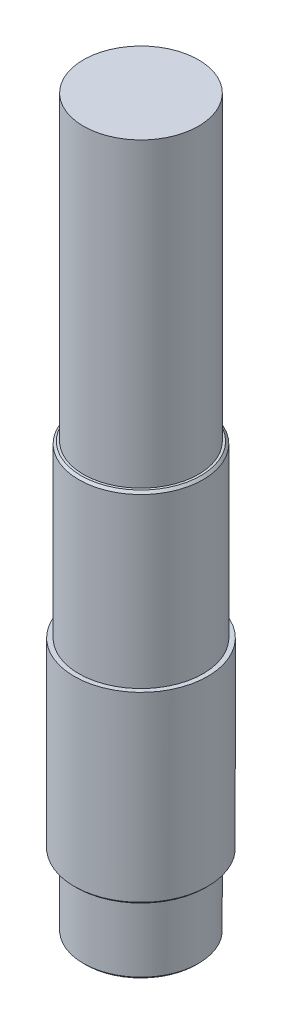
ISO-10303-21;
HEADER;
FILE_DESCRIPTION(('STEP AP214'),'2;1');
FILE_NAME('part.step','',(''),(''),'','','');
FILE_SCHEMA(('AUTOMOTIVE_DESIGN { 1 0 10303 214 1 1 1 1 }'));
ENDSEC;
DATA;
#1=APPLICATION_CONTEXT('core data for automotive mechanical design processes');
#2=APPLICATION_PROTOCOL_DEFINITION('international standard','automotive_design',2000,#1);
#3=PRODUCT_CONTEXT('',#1,'mechanical');
#4=PRODUCT('Part','Part','',(#3));
#5=PRODUCT_RELATED_PRODUCT_CATEGORY('part','',(#4));
#6=PRODUCT_DEFINITION_FORMATION('','',#4);
#7=PRODUCT_DEFINITION_CONTEXT('part definition',#1,'design');
#8=PRODUCT_DEFINITION('design','',#6,#7);
#9=PRODUCT_DEFINITION_SHAPE('','',#8);
#10=(LENGTH_UNIT() NAMED_UNIT(*) SI_UNIT(.MILLI.,.METRE.));
#11=(NAMED_UNIT(*) PLANE_ANGLE_UNIT() SI_UNIT($,.RADIAN.));
#12=(NAMED_UNIT(*) SI_UNIT($,.STERADIAN.) SOLID_ANGLE_UNIT());
#13=UNCERTAINTY_MEASURE_WITH_UNIT(LENGTH_MEASURE(1.E-05),#10,'distance_accuracy_value','');
#14=(GEOMETRIC_REPRESENTATION_CONTEXT(3) GLOBAL_UNCERTAINTY_ASSIGNED_CONTEXT((#13)) GLOBAL_UNIT_ASSIGNED_CONTEXT((#10,
#11,#12)) REPRESENTATION_CONTEXT('',''));
#15=CARTESIAN_POINT('',(0.,0.,0.));
#16=DIRECTION('',(0.,0.,1.));
#17=DIRECTION('',(1.,0.,0.));
#18=AXIS2_PLACEMENT_3D('',#15,#16,#17);
#19=CARTESIAN_POINT('',(0.,87.3913043478261,0.));
#20=DIRECTION('',(0.,1.,0.));
#21=DIRECTION('',(0.,0.,1.));
#22=AXIS2_PLACEMENT_3D('',#19,#20,#21);
#23=CYLINDRICAL_SURFACE('',#22,25.);
#24=CARTESIAN_POINT('',(0.,56.3913043478261,0.));
#25=DIRECTION('',(0.,1.,0.));
#26=DIRECTION('',(0.,0.,1.));
#27=AXIS2_PLACEMENT_3D('',#24,#25,#26);
#28=CIRCLE('',#27,25.);
#29=CARTESIAN_POINT('',(0.,56.3913043478261,25.));
#30=VERTEX_POINT('',#29);
#31=EDGE_CURVE('E136',#30,#30,#28,.T.);
#32=ORIENTED_EDGE('',*,*,#31,.T.);
#33=EDGE_LOOP('',(#32));
#34=FACE_BOUND('',#33,.T.);
#35=CARTESIAN_POINT('',(0.,187.391304347826,0.));
#36=DIRECTION('',(0.,1.,0.));
#37=DIRECTION('',(0.,0.,1.));
#38=AXIS2_PLACEMENT_3D('',#35,#36,#37);
#39=CIRCLE('',#38,25.);
#40=CARTESIAN_POINT('',(0.,187.391304347826,25.));
#41=VERTEX_POINT('',#40);
#42=EDGE_CURVE('E105',#41,#41,#39,.T.);
#43=ORIENTED_EDGE('',*,*,#42,.F.);
#44=EDGE_LOOP('',(#43));
#45=FACE_BOUND('',#44,.T.);
#46=ADVANCED_FACE('F41',(#34,#45),#23,.T.);
#47=CARTESIAN_POINT('',(-25.,56.3913043478261,0.));
#48=DIRECTION('',(0.,1.,0.));
#49=DIRECTION('',(0.,0.,1.));
#50=AXIS2_PLACEMENT_3D('',#47,#48,#49);
#51=PLANE('',#50);
#52=CARTESIAN_POINT('',(0.,56.3913043478261,0.));
#53=DIRECTION('',(0.,1.,0.));
#54=DIRECTION('',(0.,0.,1.));
#55=AXIS2_PLACEMENT_3D('',#52,#53,#54);
#56=CIRCLE('',#55,26.);
#57=CARTESIAN_POINT('',(0.,56.3913043478261,26.));
#58=VERTEX_POINT('',#57);
#59=EDGE_CURVE('E148',#58,#58,#56,.T.);
#60=ORIENTED_EDGE('',*,*,#59,.T.);
#61=EDGE_LOOP('',(#60));
#62=FACE_BOUND('',#61,.T.);
#63=ORIENTED_EDGE('',*,*,#31,.F.);
#64=EDGE_LOOP('',(#63));
#65=FACE_BOUND('',#64,.T.);
#66=ADVANCED_FACE('F203',(#62,#65),#51,.T.);
#67=CARTESIAN_POINT('',(0.,87.3913043478261,0.));
#68=DIRECTION('',(0.,1.,0.));
#69=DIRECTION('',(0.,0.,1.));
#70=AXIS2_PLACEMENT_3D('',#67,#68,#69);
#71=CYLINDRICAL_SURFACE('',#70,27.);
#72=CARTESIAN_POINT('',(-25.7875939164552,38.911705116802,8.));
#73=CARTESIAN_POINT('',(-25.7875628616702,39.131397825484,8.00002960637348));
#74=CARTESIAN_POINT('',(-25.7904003183758,39.3510792729381,7.99095167950051));
#75=CARTESIAN_POINT('',(-25.8015855612365,39.7887682714789,7.95479988213666));
#76=CARTESIAN_POINT('',(-25.8099321340495,40.0067761804568,7.92772997423787));
#77=CARTESIAN_POINT('',(-25.8318817944391,40.4390271410023,7.85590251670967));
#78=CARTESIAN_POINT('',(-25.8454717680868,40.6532782019662,7.8111890878576));
#79=CARTESIAN_POINT('',(-25.8774835872328,41.0770631359052,7.70447684520099));
#80=CARTESIAN_POINT('',(-25.8959055541593,41.2865968901905,7.64247759700054));
#81=CARTESIAN_POINT('',(-25.9370211553073,41.6993990583558,7.50175261605655));
#82=CARTESIAN_POINT('',(-25.9597123660459,41.902670951037,7.42303636965148));
#83=CARTESIAN_POINT('',(-26.0087228446599,42.3018252601322,7.24944609768949));
#84=CARTESIAN_POINT('',(-26.0350434570479,42.4977049036758,7.15456608118007));
#85=CARTESIAN_POINT('',(-26.0905704443794,42.880811193208,6.94934739689978));
#86=CARTESIAN_POINT('',(-26.1197774094702,43.0680360580964,6.83900556585143));
#87=CARTESIAN_POINT('',(-26.180274355834,43.4326672239909,6.60363499882668));
#88=CARTESIAN_POINT('',(-26.2115644479112,43.6100730017865,6.47860548132232));
#89=CARTESIAN_POINT('',(-26.2762794142755,43.9587861997689,6.21100682882993));
#90=CARTESIAN_POINT('',(-26.3097394429693,44.1297873946886,6.06804699596594));
#91=CARTESIAN_POINT('',(-26.3770553137928,44.4592320525428,5.76840763620857));
#92=CARTESIAN_POINT('',(-26.4109111624612,44.6176753076938,5.6117278823957));
#93=CARTESIAN_POINT('',(-26.4781048452257,44.9210246877542,5.28561059087526));
#94=CARTESIAN_POINT('',(-26.5114425842848,45.0659283529626,5.11617074513389));
#95=CARTESIAN_POINT('',(-26.5766930590516,45.3412073259223,4.76562331858905));
#96=CARTESIAN_POINT('',(-26.6086058356416,45.4715830506412,4.584516072888));
#97=CARTESIAN_POINT('',(-26.6707742819151,45.7194130460702,4.20796189181386));
#98=CARTESIAN_POINT('',(-26.7009828857717,45.8365495850899,4.01229784329226));
#99=CARTESIAN_POINT('',(-26.7581552760822,46.0538238248622,3.61138545306112));
#100=CARTESIAN_POINT('',(-26.7851202442125,46.1539677216314,3.40614063973835));
#101=CARTESIAN_POINT('',(-26.8350466756659,46.3364906279072,2.98742640587611));
#102=CARTESIAN_POINT('',(-26.858008194866,46.4188698853623,2.77395710017838));
#103=CARTESIAN_POINT('',(-26.8992608498159,46.565146376425,2.34033902524584));
#104=CARTESIAN_POINT('',(-26.9175521412085,46.6290442259647,2.12019047888114));
#105=CARTESIAN_POINT('',(-26.9484881220029,46.7362544310541,1.6810915561189));
#106=CARTESIAN_POINT('',(-26.9612762416528,46.7800918547577,1.4622794239887));
#107=CARTESIAN_POINT('',(-26.9815707332709,46.8493532946463,1.02152013329362));
#108=CARTESIAN_POINT('',(-26.9890772696515,46.8747778840125,0.799573072536613));
#109=CARTESIAN_POINT('',(-26.9985944902582,46.9069750596485,0.35424578220218));
#110=CARTESIAN_POINT('',(-27.0006059952982,46.9137504316238,0.130865771667076));
#111=CARTESIAN_POINT('',(-26.9990778203608,46.9085926473642,-0.3156570295136));
#112=CARTESIAN_POINT('',(-26.9955382395449,46.8966598253214,-0.538799824325399));
#113=CARTESIAN_POINT('',(-26.9832061949929,46.8548655343941,-0.97619095265371));
#114=CARTESIAN_POINT('',(-26.9745816226041,46.8255769513461,-1.19049906423914));
#115=CARTESIAN_POINT('',(-26.9524459467939,46.7497951432446,-1.61586825577758));
#116=CARTESIAN_POINT('',(-26.938933207224,46.7032961574703,-1.82692822383494));
#117=CARTESIAN_POINT('',(-26.9073837322259,46.5935056865423,-2.24420823618411));
#118=CARTESIAN_POINT('',(-26.8893485034535,46.530219793499,-2.45042986738414));
#119=CARTESIAN_POINT('',(-26.8492143437572,46.3873329093306,-2.85681641733498));
#120=CARTESIAN_POINT('',(-26.8271138856206,46.3077257854046,-3.0569790268306));
#121=CARTESIAN_POINT('',(-26.7791567788165,46.131848628904,-3.45207239061677));
#122=CARTESIAN_POINT('',(-26.753261162676,46.0354034612365,-3.64692041889215));
#123=CARTESIAN_POINT('',(-26.6985625126211,45.827146853307,-4.02787897880358));
#124=CARTESIAN_POINT('',(-26.6697584815258,45.7153301379652,-4.21398648139633));
#125=CARTESIAN_POINT('',(-26.6099889077739,45.4771294940877,-4.57626483368281));
#126=CARTESIAN_POINT('',(-26.5790233498109,45.3507454623918,-4.75243561299525));
#127=CARTESIAN_POINT('',(-26.5157195353945,45.0842357297938,-5.09379604977026));
#128=CARTESIAN_POINT('',(-26.4833812399672,44.9441096385865,-5.25898539511194));
#129=CARTESIAN_POINT('',(-26.4169236189529,44.6454504693369,-5.58342133511416));
#130=CARTESIAN_POINT('',(-26.3827831476584,44.4864221675424,-5.74220807182533));
#131=CARTESIAN_POINT('',(-26.3148652712975,44.155590050217,-6.04583040421573));
#132=CARTESIAN_POINT('',(-26.2810877527561,43.9837903689452,-6.19067048005944));
#133=CARTESIAN_POINT('',(-26.2148077749369,43.6283402689371,-6.46559092955974));
#134=CARTESIAN_POINT('',(-26.1823061764369,43.4446820636958,-6.59566144745518));
#135=CARTESIAN_POINT('',(-26.1195451631916,43.0668610855521,-6.83997573312998));
#136=CARTESIAN_POINT('',(-26.089284879471,42.8727024348057,-6.95422564977779));
#137=CARTESIAN_POINT('',(-26.0315916367044,42.473059330601,-7.16718478187234));
#138=CARTESIAN_POINT('',(-26.0041904120745,42.2674800956456,-7.26572490624362));
#139=CARTESIAN_POINT('',(-25.9534283091206,41.8483178551212,-7.44501460023963));
#140=CARTESIAN_POINT('',(-25.9300657823772,41.6347381585039,-7.52577143192785));
#141=CARTESIAN_POINT('',(-25.8881357781189,41.2012575397424,-7.66876663345914));
#142=CARTESIAN_POINT('',(-25.8695632646646,40.981363528728,-7.73102446263393));
#143=CARTESIAN_POINT('',(-25.8377961282602,40.536774757578,-7.836537473345));
#144=CARTESIAN_POINT('',(-25.8245990221313,40.3120822647112,-7.87980142985505));
#145=CARTESIAN_POINT('',(-25.8054734018974,39.8915410335106,-7.9421969480022));
#146=CARTESIAN_POINT('',(-25.7987815539257,39.6961005738651,-7.9638738523907));
#147=CARTESIAN_POINT('',(-25.7898355738642,39.3043468186609,-7.9927731450363));
#148=CARTESIAN_POINT('',(-25.7875748486612,39.108035256133,-8.00001700863013));
#149=CARTESIAN_POINT('',(-25.7875939164552,38.911705116802,-8.));
#150=B_SPLINE_CURVE_WITH_KNOTS('',3,(#72,#73,#74,#75,#76,#77,#78,#79,#80,#81,#82,#83,#84,#85,
#86,#87,#88,#89,#90,#91,#92,#93,#94,#95,#96,#97,#98,#99,#100,#101,#102,#103,#104,#105,#106,#107,
#108,#109,#110,#111,#112,#113,#114,#115,#116,#117,#118,#119,#120,#121,#122,#123,#124,#125,#126,
#127,#128,#129,#130,#131,#132,#133,#134,#135,#136,#137,#138,#139,#140,#141,#142,#143,#144,#145,
#146,#147,#148,#149),.UNSPECIFIED.,.F.,.F.,(4,2,2,2,2,2,2,2,2,2,2,2,2,2,2,2,2,2,2,2,2,2,2,2,2,2,
2,2,2,2,2,2,2,2,2,2,2,2,4),(0.,0.658854993446906,1.31756492733443,1.97463797350892,
2.63172753354213,3.28844520880093,3.945406822098,4.60250303759593,5.2596342328621,
5.9350165709738,6.61041008162646,7.28592605162941,7.96142262860486,8.65069477564224,
9.33971505119042,10.0287257091685,10.7177134017575,11.3874592450027,12.0571842385397,
12.726809187238,13.3964221742889,14.0450752449532,14.693945631482,15.3426001350138,
15.9914988225676,16.6475996408492,17.3039261790308,17.9602573653548,18.6166071983477,
19.2977382995345,19.978649862033,20.6600131608745,21.3411108918289,22.0291058464085,
22.7168193251783,23.4038068074954,24.0904765738187,24.6801642951606,25.268973945975),.UNSPECIFIED.);
#151=CARTESIAN_POINT('',(-25.7875939164552,38.911705116802,8.));
#152=VERTEX_POINT('',#151);
#153=CARTESIAN_POINT('',(-25.7875939164552,38.911705116802,-8.));
#154=VERTEX_POINT('',#153);
#155=EDGE_CURVE('E164',#152,#154,#150,.T.);
#156=ORIENTED_EDGE('',*,*,#155,.F.);
#157=DIRECTION('',(0.,1.,0.));
#158=VECTOR('',#157,1.);
#159=CARTESIAN_POINT('',(-25.7875939164552,87.3913043478261,8.));
#160=LINE('',#159,#158);
#161=CARTESIAN_POINT('',(-25.7875939164552,-9.088294883198,8.));
#162=VERTEX_POINT('',#161);
#163=EDGE_CURVE('E11',#162,#152,#160,.T.);
#164=ORIENTED_EDGE('',*,*,#163,.F.);
#165=CARTESIAN_POINT('',(-25.7875939164552,-9.088294883198,-8.));
#166=CARTESIAN_POINT('',(-25.7875628616702,-9.30798759187996,-8.00002960637348));
#167=CARTESIAN_POINT('',(-25.7904003183758,-9.52766903933414,-7.99095167950051));
#168=CARTESIAN_POINT('',(-25.8015855612365,-9.96535803787485,-7.95479988213667));
#169=CARTESIAN_POINT('',(-25.8099321340495,-10.1833659468528,-7.92772997423787));
#170=CARTESIAN_POINT('',(-25.8318817944391,-10.6156169073983,-7.85590251670967));
#171=CARTESIAN_POINT('',(-25.8454717680868,-10.8298679683622,-7.81118908785759));
#172=CARTESIAN_POINT('',(-25.8774835872328,-11.2536529023012,-7.70447684520099));
#173=CARTESIAN_POINT('',(-25.8959055541593,-11.4631866565865,-7.64247759700054));
#174=CARTESIAN_POINT('',(-25.9370211553073,-11.8759888247518,-7.50175261605655));
#175=CARTESIAN_POINT('',(-25.9597123660459,-12.079260717433,-7.42303636965148));
#176=CARTESIAN_POINT('',(-26.0087228446599,-12.4784150265282,-7.24944609768949));
#177=CARTESIAN_POINT('',(-26.0350434570479,-12.6742946700718,-7.15456608118007));
#178=CARTESIAN_POINT('',(-26.0905704443794,-13.057400959604,-6.94934739689978));
#179=CARTESIAN_POINT('',(-26.1197774094702,-13.2446258244923,-6.83900556585143));
#180=CARTESIAN_POINT('',(-26.180274355834,-13.6092569903869,-6.60363499882668));
#181=CARTESIAN_POINT('',(-26.2115644479112,-13.7866627681825,-6.47860548132232));
#182=CARTESIAN_POINT('',(-26.2762794142755,-14.1353759661649,-6.21100682882993));
#183=CARTESIAN_POINT('',(-26.3097394429693,-14.3063771610846,-6.06804699596593));
#184=CARTESIAN_POINT('',(-26.3770553137928,-14.6358218189388,-5.76840763620856));
#185=CARTESIAN_POINT('',(-26.4109111624612,-14.7942650740898,-5.6117278823957));
#186=CARTESIAN_POINT('',(-26.4781048452257,-15.0976144541502,-5.28561059087525));
#187=CARTESIAN_POINT('',(-26.5114425842848,-15.2425181193586,-5.11617074513389));
#188=CARTESIAN_POINT('',(-26.5766930590516,-15.5177970923183,-4.76562331858905));
#189=CARTESIAN_POINT('',(-26.6086058356416,-15.6481728170372,-4.584516072888));
#190=CARTESIAN_POINT('',(-26.6707742819151,-15.8960028124662,-4.20796189181386));
#191=CARTESIAN_POINT('',(-26.7009828857717,-16.0131393514859,-4.01229784329226));
#192=CARTESIAN_POINT('',(-26.7581552760822,-16.2304135912582,-3.61138545306111));
#193=CARTESIAN_POINT('',(-26.7851202442125,-16.3305574880274,-3.40614063973835));
#194=CARTESIAN_POINT('',(-26.8350466756659,-16.5130803943032,-2.9874264058761));
#195=CARTESIAN_POINT('',(-26.858008194866,-16.5954596517583,-2.77395710017838));
#196=CARTESIAN_POINT('',(-26.8992608498159,-16.741736142821,-2.34033902524584));
#197=CARTESIAN_POINT('',(-26.9175521412085,-16.8056339923607,-2.12019047888113));
#198=CARTESIAN_POINT('',(-26.9484881220029,-16.9128441974501,-1.68109155611889));
#199=CARTESIAN_POINT('',(-26.9612762416528,-16.9566816211537,-1.46227942398869));
#200=CARTESIAN_POINT('',(-26.9815707332709,-17.0259430610423,-1.02152013329361));
#201=CARTESIAN_POINT('',(-26.9890772696515,-17.0513676504085,-0.799573072536602));
#202=CARTESIAN_POINT('',(-26.9985944902582,-17.0835648260445,-0.354245782202168));
#203=CARTESIAN_POINT('',(-27.0006059952982,-17.0903401980198,-0.130865771667063));
#204=CARTESIAN_POINT('',(-26.9990778203608,-17.0851824137602,0.315657029513613));
#205=CARTESIAN_POINT('',(-26.9955382395449,-17.0732495917174,0.538799824325414));
#206=CARTESIAN_POINT('',(-26.9832061949929,-17.0314553007901,0.976190952653725));
#207=CARTESIAN_POINT('',(-26.9745816226041,-17.002166717742,1.19049906423916));
#208=CARTESIAN_POINT('',(-26.9524459467939,-16.9263849096406,1.61586825577759));
#209=CARTESIAN_POINT('',(-26.938933207224,-16.8798859238663,1.82692822383496));
#210=CARTESIAN_POINT('',(-26.9073837322259,-16.7700954529383,2.24420823618413));
#211=CARTESIAN_POINT('',(-26.8893485034535,-16.706809559895,2.45042986738416));
#212=CARTESIAN_POINT('',(-26.8492143437572,-16.5639226757266,2.85681641733499));
#213=CARTESIAN_POINT('',(-26.8271138856206,-16.4843155518006,3.05697902683061));
#214=CARTESIAN_POINT('',(-26.7791567788165,-16.3084383953,3.45207239061678));
#215=CARTESIAN_POINT('',(-26.753261162676,-16.2119932276325,3.64692041889216));
#216=CARTESIAN_POINT('',(-26.6985625126211,-16.0037366197029,4.02787897880359));
#217=CARTESIAN_POINT('',(-26.6697584815258,-15.8919199043612,4.21398648139635));
#218=CARTESIAN_POINT('',(-26.6099889077739,-15.6537192604837,4.57626483368283));
#219=CARTESIAN_POINT('',(-26.5790233498109,-15.5273352287878,4.75243561299527));
#220=CARTESIAN_POINT('',(-26.5157195353945,-15.2608254961897,5.09379604977027));
#221=CARTESIAN_POINT('',(-26.4833812399672,-15.1206994049825,5.25898539511195));
#222=CARTESIAN_POINT('',(-26.4169236189528,-14.8220402357329,5.58342133511418));
#223=CARTESIAN_POINT('',(-26.3827831476584,-14.6630119339384,5.74220807182534));
#224=CARTESIAN_POINT('',(-26.3148652712975,-14.332179816613,6.04583040421575));
#225=CARTESIAN_POINT('',(-26.2810877527561,-14.1603801353411,6.19067048005945));
#226=CARTESIAN_POINT('',(-26.2148077749369,-13.8049300353331,6.46559092955975));
#227=CARTESIAN_POINT('',(-26.1823061764369,-13.6212718300918,6.59566144745519));
#228=CARTESIAN_POINT('',(-26.1195451631916,-13.2434508519481,6.83997573312998));
#229=CARTESIAN_POINT('',(-26.089284879471,-13.0492922012017,6.9542256497778));
#230=CARTESIAN_POINT('',(-26.0315916367044,-12.649649096997,7.16718478187234));
#231=CARTESIAN_POINT('',(-26.0041904120745,-12.4440698620416,7.26572490624362));
#232=CARTESIAN_POINT('',(-25.9534283091206,-12.0249076215172,7.44501460023963));
#233=CARTESIAN_POINT('',(-25.9300657823772,-11.8113279248999,7.52577143192786));
#234=CARTESIAN_POINT('',(-25.8881357781189,-11.3778473061384,7.66876663345914));
#235=CARTESIAN_POINT('',(-25.8695632646646,-11.1579532951239,7.73102446263394));
#236=CARTESIAN_POINT('',(-25.8377961282602,-10.713364523974,7.836537473345));
#237=CARTESIAN_POINT('',(-25.8245990221313,-10.4886720311072,7.87980142985505));
#238=CARTESIAN_POINT('',(-25.8054734018974,-10.0681307999066,7.9421969480022));
#239=CARTESIAN_POINT('',(-25.7987815539257,-9.87269034026111,7.9638738523907));
#240=CARTESIAN_POINT('',(-25.7898355738642,-9.4809365850569,7.9927731450363));
#241=CARTESIAN_POINT('',(-25.7875748486612,-9.28462502252895,8.00001700863013));
#242=CARTESIAN_POINT('',(-25.7875939164552,-9.088294883198,8.));
#243=B_SPLINE_CURVE_WITH_KNOTS('',3,(#165,#166,#167,#168,#169,#170,#171,#172,#173,#174,#175,
#176,#177,#178,#179,#180,#181,#182,#183,#184,#185,#186,#187,#188,#189,#190,#191,#192,#193,#194,
#195,#196,#197,#198,#199,#200,#201,#202,#203,#204,#205,#206,#207,#208,#209,#210,#211,#212,#213,
#214,#215,#216,#217,#218,#219,#220,#221,#222,#223,#224,#225,#226,#227,#228,#229,#230,#231,#232,
#233,#234,#235,#236,#237,#238,#239,#240,#241,#242),.UNSPECIFIED.,.F.,.F.,(4,2,2,2,2,2,2,2,2,2,2,
2,2,2,2,2,2,2,2,2,2,2,2,2,2,2,2,2,2,2,2,2,2,2,2,2,2,2,4),(0.,0.658854993446913,1.31756492733444,
1.97463797350893,2.63172753354214,3.28844520880093,3.945406822098,4.60250303759593,
5.2596342328621,5.93501657097381,6.61041008162647,7.28592605162941,7.96142262860486,
8.65069477564224,9.33971505119043,10.0287257091685,10.7177134017575,11.3874592450027,
12.0571842385397,12.726809187238,13.3964221742889,14.0450752449532,14.693945631482,
15.3426001350138,15.9914988225676,16.6475996408492,17.3039261790308,17.9602573653548,
18.6166071983477,19.2977382995345,19.978649862033,20.6600131608745,21.3411108918289,
22.0291058464085,22.7168193251784,23.4038068074954,24.0904765738187,24.6801642951606,
25.268973945975),.UNSPECIFIED.);
#244=CARTESIAN_POINT('',(-25.7875939164552,-9.088294883198,-8.));
#245=VERTEX_POINT('',#244);
#246=EDGE_CURVE('E51',#245,#162,#243,.T.);
#247=ORIENTED_EDGE('',*,*,#246,.F.);
#248=DIRECTION('',(0.,1.,0.));
#249=VECTOR('',#248,1.);
#250=CARTESIAN_POINT('',(-25.7875939164552,87.3913043478261,-8.));
#251=LINE('',#250,#249);
#252=EDGE_CURVE('E173',#154,#245,#251,.F.);
#253=ORIENTED_EDGE('',*,*,#252,.F.);
#254=EDGE_LOOP('',(#156,#164,#247,#253));
#255=FACE_BOUND('',#254,.T.);
#256=CARTESIAN_POINT('',(0.,55.3913043478261,0.));
#257=DIRECTION('',(0.,1.,0.));
#258=DIRECTION('',(0.,0.,1.));
#259=AXIS2_PLACEMENT_3D('',#256,#257,#258);
#260=CIRCLE('',#259,27.);
#261=CARTESIAN_POINT('',(0.,55.3913043478261,27.));
#262=VERTEX_POINT('',#261);
#263=EDGE_CURVE('E152',#262,#262,#260,.F.);
#264=ORIENTED_EDGE('',*,*,#263,.T.);
#265=EDGE_LOOP('',(#264));
#266=FACE_BOUND('',#265,.T.);
#267=CARTESIAN_POINT('',(0.,-17.6086956521739,0.));
#268=DIRECTION('',(0.,1.,0.));
#269=DIRECTION('',(0.,0.,1.));
#270=AXIS2_PLACEMENT_3D('',#267,#268,#269);
#271=CIRCLE('',#270,27.);
#272=CARTESIAN_POINT('',(0.,-17.6086956521739,27.));
#273=VERTEX_POINT('',#272);
#274=EDGE_CURVE('E132',#273,#273,#271,.T.);
#275=ORIENTED_EDGE('',*,*,#274,.T.);
#276=EDGE_LOOP('',(#275));
#277=FACE_BOUND('',#276,.T.);
#278=ADVANCED_FACE('F174',(#255,#266,#277),#71,.T.);
#279=CARTESIAN_POINT('',(-27.,-17.6086956521739,0.));
#280=DIRECTION('',(0.,1.,0.));
#281=DIRECTION('',(0.,0.,1.));
#282=AXIS2_PLACEMENT_3D('',#279,#280,#281);
#283=PLANE('',#282);
#284=CARTESIAN_POINT('',(0.,-17.6086956521739,0.));
#285=DIRECTION('',(0.,1.,0.));
#286=DIRECTION('',(0.,0.,1.));
#287=AXIS2_PLACEMENT_3D('',#284,#285,#286);
#288=CIRCLE('',#287,29.);
#289=CARTESIAN_POINT('',(0.,-17.6086956521739,29.));
#290=VERTEX_POINT('',#289);
#291=EDGE_CURVE('E128',#290,#290,#288,.T.);
#292=ORIENTED_EDGE('',*,*,#291,.T.);
#293=EDGE_LOOP('',(#292));
#294=FACE_BOUND('',#293,.T.);
#295=ORIENTED_EDGE('',*,*,#274,.F.);
#296=EDGE_LOOP('',(#295));
#297=FACE_BOUND('',#296,.T.);
#298=ADVANCED_FACE('F202',(#294,#297),#283,.T.);
#299=CARTESIAN_POINT('',(0.,87.3913043478261,0.));
#300=DIRECTION('',(0.,1.,0.));
#301=DIRECTION('',(0.,0.,1.));
#302=AXIS2_PLACEMENT_3D('',#299,#300,#301);
#303=CYLINDRICAL_SURFACE('',#302,29.);
#304=CARTESIAN_POINT('',(0.,-96.6086956521739,0.));
#305=DIRECTION('',(0.,-1.,0.));
#306=DIRECTION('',(0.,0.,-1.));
#307=AXIS2_PLACEMENT_3D('',#304,#305,#306);
#308=CIRCLE('',#307,29.);
#309=CARTESIAN_POINT('',(0.,-96.6086956521739,-29.));
#310=VERTEX_POINT('',#309);
#311=EDGE_CURVE('E140',#310,#310,#308,.F.);
#312=ORIENTED_EDGE('',*,*,#311,.T.);
#313=EDGE_LOOP('',(#312));
#314=FACE_BOUND('',#313,.T.);
#315=ORIENTED_EDGE('',*,*,#291,.F.);
#316=EDGE_LOOP('',(#315));
#317=FACE_BOUND('',#316,.T.);
#318=ADVANCED_FACE('F209',(#314,#317),#303,.T.);
#319=CARTESIAN_POINT('',(-29.,-97.6086956521739,0.));
#320=DIRECTION('',(0.,-1.,0.));
#321=DIRECTION('',(0.,0.,-1.));
#322=AXIS2_PLACEMENT_3D('',#319,#320,#321);
#323=PLANE('',#322);
#324=CARTESIAN_POINT('',(0.,-97.6086956521739,0.));
#325=DIRECTION('',(0.,-1.,0.));
#326=DIRECTION('',(0.,0.,-1.));
#327=AXIS2_PLACEMENT_3D('',#324,#325,#326);
#328=CIRCLE('',#327,28.);
#329=CARTESIAN_POINT('',(0.,-97.6086956521739,-28.));
#330=VERTEX_POINT('',#329);
#331=EDGE_CURVE('E144',#330,#330,#328,.T.);
#332=ORIENTED_EDGE('',*,*,#331,.T.);
#333=EDGE_LOOP('',(#332));
#334=FACE_BOUND('',#333,.T.);
#335=CARTESIAN_POINT('',(0.,-97.6086956521739,0.));
#336=DIRECTION('',(0.,1.,0.));
#337=DIRECTION('',(0.,0.,1.));
#338=AXIS2_PLACEMENT_3D('',#335,#336,#337);
#339=CIRCLE('',#338,25.);
#340=CARTESIAN_POINT('',(0.,-97.6086956521739,25.));
#341=VERTEX_POINT('',#340);
#342=EDGE_CURVE('E118',#341,#341,#339,.T.);
#343=ORIENTED_EDGE('',*,*,#342,.T.);
#344=EDGE_LOOP('',(#343));
#345=FACE_BOUND('',#344,.T.);
#346=ADVANCED_FACE('F214',(#334,#345),#323,.T.);
#347=CARTESIAN_POINT('',(0.,87.3913043478261,0.));
#348=DIRECTION('',(0.,1.,0.));
#349=DIRECTION('',(0.,0.,1.));
#350=AXIS2_PLACEMENT_3D('',#347,#348,#349);
#351=CYLINDRICAL_SURFACE('',#350,25.);
#352=CARTESIAN_POINT('',(0.,-127.608695652174,0.));
#353=DIRECTION('',(0.,-1.,0.));
#354=DIRECTION('',(0.,0.,-1.));
#355=AXIS2_PLACEMENT_3D('',#352,#353,#354);
#356=CIRCLE('',#355,25.);
#357=CARTESIAN_POINT('',(0.,-127.608695652174,-25.));
#358=VERTEX_POINT('',#357);
#359=EDGE_CURVE('E156',#358,#358,#356,.F.);
#360=ORIENTED_EDGE('',*,*,#359,.T.);
#361=EDGE_LOOP('',(#360));
#362=FACE_BOUND('',#361,.T.);
#363=ORIENTED_EDGE('',*,*,#342,.F.);
#364=EDGE_LOOP('',(#363));
#365=FACE_BOUND('',#364,.T.);
#366=ADVANCED_FACE('F252',(#362,#365),#351,.T.);
#367=CARTESIAN_POINT('',(-25.,-128.608695652174,0.));
#368=DIRECTION('',(0.,-1.,0.));
#369=DIRECTION('',(0.,0.,-1.));
#370=AXIS2_PLACEMENT_3D('',#367,#368,#369);
#371=PLANE('',#370);
#372=CARTESIAN_POINT('',(0.,-128.608695652174,0.));
#373=DIRECTION('',(0.,-1.,0.));
#374=DIRECTION('',(0.,0.,-1.));
#375=AXIS2_PLACEMENT_3D('',#372,#373,#374);
#376=CIRCLE('',#375,23.9999999999999);
#377=CARTESIAN_POINT('',(0.,-128.608695652174,-23.9999999999999));
#378=VERTEX_POINT('',#377);
#379=EDGE_CURVE('E160',#378,#378,#376,.T.);
#380=ORIENTED_EDGE('',*,*,#379,.T.);
#381=EDGE_LOOP('',(#380));
#382=FACE_BOUND('',#381,.T.);
#383=ADVANCED_FACE('F191',(#382),#371,.T.);
#384=CARTESIAN_POINT('',(0.,-96.6086956521739,0.));
#385=DIRECTION('',(0.,1.,0.));
#386=DIRECTION('',(0.,0.,1.));
#387=AXIS2_PLACEMENT_3D('',#384,#385,#386);
#388=CONICAL_SURFACE('',#387,29.,0.785398163397426);
#389=ORIENTED_EDGE('',*,*,#331,.F.);
#390=EDGE_LOOP('',(#389));
#391=FACE_BOUND('',#390,.T.);
#392=ORIENTED_EDGE('',*,*,#311,.F.);
#393=EDGE_LOOP('',(#392));
#394=FACE_BOUND('',#393,.T.);
#395=ADVANCED_FACE('F227',(#391,#394),#388,.T.);
#396=CARTESIAN_POINT('',(0.,56.3913043478261,0.));
#397=DIRECTION('',(0.,-1.,0.));
#398=DIRECTION('',(0.,0.,-1.));
#399=AXIS2_PLACEMENT_3D('',#396,#397,#398);
#400=CONICAL_SURFACE('',#399,26.,0.785398163397443);
#401=ORIENTED_EDGE('',*,*,#263,.F.);
#402=EDGE_LOOP('',(#401));
#403=FACE_BOUND('',#402,.T.);
#404=ORIENTED_EDGE('',*,*,#59,.F.);
#405=EDGE_LOOP('',(#404));
#406=FACE_BOUND('',#405,.T.);
#407=ADVANCED_FACE('F232',(#403,#406),#400,.T.);
#408=CARTESIAN_POINT('',(0.,-127.608695652174,0.));
#409=DIRECTION('',(0.,1.,0.));
#410=DIRECTION('',(0.,0.,1.));
#411=AXIS2_PLACEMENT_3D('',#408,#409,#410);
#412=CONICAL_SURFACE('',#411,25.,0.78539816339744);
#413=ORIENTED_EDGE('',*,*,#379,.F.);
#414=EDGE_LOOP('',(#413));
#415=FACE_BOUND('',#414,.T.);
#416=ORIENTED_EDGE('',*,*,#359,.F.);
#417=EDGE_LOOP('',(#416));
#418=FACE_BOUND('',#417,.T.);
#419=ADVANCED_FACE('F44',(#415,#418),#412,.T.);
#420=CARTESIAN_POINT('',(-21.,-9.088294883198,0.));
#421=DIRECTION('',(-1.,0.,0.));
#422=DIRECTION('',(0.,0.,1.));
#423=AXIS2_PLACEMENT_3D('',#420,#421,#422);
#424=CYLINDRICAL_SURFACE('',#423,8.);
#425=DIRECTION('',(-1.,0.,0.));
#426=VECTOR('',#425,1.);
#427=CARTESIAN_POINT('',(-21.,-9.088294883198,-8.));
#428=LINE('',#427,#426);
#429=CARTESIAN_POINT('',(-21.,-9.088294883198,-8.));
#430=VERTEX_POINT('',#429);
#431=EDGE_CURVE('E115',#430,#245,#428,.T.);
#432=ORIENTED_EDGE('',*,*,#431,.T.);
#433=ORIENTED_EDGE('',*,*,#246,.T.);
#434=DIRECTION('',(-1.,0.,0.));
#435=VECTOR('',#434,1.);
#436=CARTESIAN_POINT('',(-21.,-9.088294883198,8.));
#437=LINE('',#436,#435);
#438=CARTESIAN_POINT('',(-21.,-9.088294883198,8.));
#439=VERTEX_POINT('',#438);
#440=EDGE_CURVE('E57',#439,#162,#437,.T.);
#441=ORIENTED_EDGE('',*,*,#440,.F.);
#442=CARTESIAN_POINT('',(-21.,-9.088294883198,0.));
#443=DIRECTION('',(-1.,0.,0.));
#444=DIRECTION('',(0.,0.,1.));
#445=AXIS2_PLACEMENT_3D('',#442,#443,#444);
#446=CIRCLE('',#445,8.);
#447=EDGE_CURVE('E86',#430,#439,#446,.T.);
#448=ORIENTED_EDGE('',*,*,#447,.F.);
#449=EDGE_LOOP('',(#432,#433,#441,#448));
#450=FACE_BOUND('',#449,.T.);
#451=ADVANCED_FACE('F84',(#450),#424,.F.);
#452=CARTESIAN_POINT('',(-21.,-9.088294883198,-8.));
#453=DIRECTION('',(0.,0.,-1.));
#454=DIRECTION('',(-1.,0.,0.));
#455=AXIS2_PLACEMENT_3D('',#452,#453,#454);
#456=PLANE('',#455);
#457=ORIENTED_EDGE('',*,*,#252,.T.);
#458=ORIENTED_EDGE('',*,*,#431,.F.);
#459=DIRECTION('',(0.,-1.,0.));
#460=VECTOR('',#459,1.);
#461=CARTESIAN_POINT('',(-21.,-9.088294883198,-8.));
#462=LINE('',#461,#460);
#463=CARTESIAN_POINT('',(-21.,38.911705116802,-8.));
#464=VERTEX_POINT('',#463);
#465=EDGE_CURVE('E90',#464,#430,#462,.T.);
#466=ORIENTED_EDGE('',*,*,#465,.F.);
#467=DIRECTION('',(-1.,0.,0.));
#468=VECTOR('',#467,1.);
#469=CARTESIAN_POINT('',(-21.,38.911705116802,-8.));
#470=LINE('',#469,#468);
#471=EDGE_CURVE('E119',#464,#154,#470,.T.);
#472=ORIENTED_EDGE('',*,*,#471,.T.);
#473=EDGE_LOOP('',(#457,#458,#466,#472));
#474=FACE_BOUND('',#473,.T.);
#475=ADVANCED_FACE('F183',(#474),#456,.F.);
#476=CARTESIAN_POINT('',(-21.,38.911705116802,0.));
#477=DIRECTION('',(-1.,0.,0.));
#478=DIRECTION('',(0.,0.,1.));
#479=AXIS2_PLACEMENT_3D('',#476,#477,#478);
#480=CYLINDRICAL_SURFACE('',#479,8.);
#481=DIRECTION('',(-1.,0.,0.));
#482=VECTOR('',#481,1.);
#483=CARTESIAN_POINT('',(-21.,38.911705116802,8.));
#484=LINE('',#483,#482);
#485=CARTESIAN_POINT('',(-21.,38.911705116802,8.));
#486=VERTEX_POINT('',#485);
#487=EDGE_CURVE('E89',#486,#152,#484,.T.);
#488=ORIENTED_EDGE('',*,*,#487,.T.);
#489=ORIENTED_EDGE('',*,*,#155,.T.);
#490=ORIENTED_EDGE('',*,*,#471,.F.);
#491=CARTESIAN_POINT('',(-21.,38.911705116802,0.));
#492=DIRECTION('',(-1.,0.,0.));
#493=DIRECTION('',(0.,0.,1.));
#494=AXIS2_PLACEMENT_3D('',#491,#492,#493);
#495=CIRCLE('',#494,8.);
#496=EDGE_CURVE('E100',#486,#464,#495,.T.);
#497=ORIENTED_EDGE('',*,*,#496,.F.);
#498=EDGE_LOOP('',(#488,#489,#490,#497));
#499=FACE_BOUND('',#498,.T.);
#500=ADVANCED_FACE('F178',(#499),#480,.F.);
#501=CARTESIAN_POINT('',(-21.,-9.088294883198,8.));
#502=DIRECTION('',(0.,0.,1.));
#503=DIRECTION('',(1.,0.,0.));
#504=AXIS2_PLACEMENT_3D('',#501,#502,#503);
#505=PLANE('',#504);
#506=ORIENTED_EDGE('',*,*,#163,.T.);
#507=ORIENTED_EDGE('',*,*,#487,.F.);
#508=DIRECTION('',(0.,1.,0.));
#509=VECTOR('',#508,1.);
#510=CARTESIAN_POINT('',(-21.,-9.088294883198,8.));
#511=LINE('',#510,#509);
#512=EDGE_CURVE('E93',#439,#486,#511,.T.);
#513=ORIENTED_EDGE('',*,*,#512,.F.);
#514=ORIENTED_EDGE('',*,*,#440,.T.);
#515=EDGE_LOOP('',(#506,#507,#513,#514));
#516=FACE_BOUND('',#515,.T.);
#517=ADVANCED_FACE('F94',(#516),#505,.F.);
#518=CARTESIAN_POINT('',(-21.,-9.088294883198,0.));
#519=DIRECTION('',(-1.,0.,0.));
#520=DIRECTION('',(0.,0.,1.));
#521=AXIS2_PLACEMENT_3D('',#518,#519,#520);
#522=PLANE('',#521);
#523=ORIENTED_EDGE('',*,*,#447,.T.);
#524=ORIENTED_EDGE('',*,*,#512,.T.);
#525=ORIENTED_EDGE('',*,*,#496,.T.);
#526=ORIENTED_EDGE('',*,*,#465,.T.);
#527=EDGE_LOOP('',(#523,#524,#525,#526));
#528=FACE_BOUND('',#527,.T.);
#529=ADVANCED_FACE('F102',(#528),#522,.T.);
#530=CARTESIAN_POINT('',(0.,187.391304347826,0.));
#531=DIRECTION('',(0.,1.,0.));
#532=DIRECTION('',(0.,0.,1.));
#533=AXIS2_PLACEMENT_3D('',#530,#531,#532);
#534=PLANE('',#533);
#535=ORIENTED_EDGE('',*,*,#42,.T.);
#536=EDGE_LOOP('',(#535));
#537=FACE_BOUND('',#536,.T.);
#538=ADVANCED_FACE('F332',(#537),#534,.T.);
#539=CLOSED_SHELL('',(#46,#66,#278,#298,#318,#346,#366,#383,#395,#407,#419,#451,#475,#500,#517,
#529,#538));
#540=MANIFOLD_SOLID_BREP('B2',#539);
#541=ADVANCED_BREP_SHAPE_REPRESENTATION('',(#18,#540),#14);
#542=SHAPE_DEFINITION_REPRESENTATION(#9,#541);
ENDSEC;
END-ISO-10303-21;
